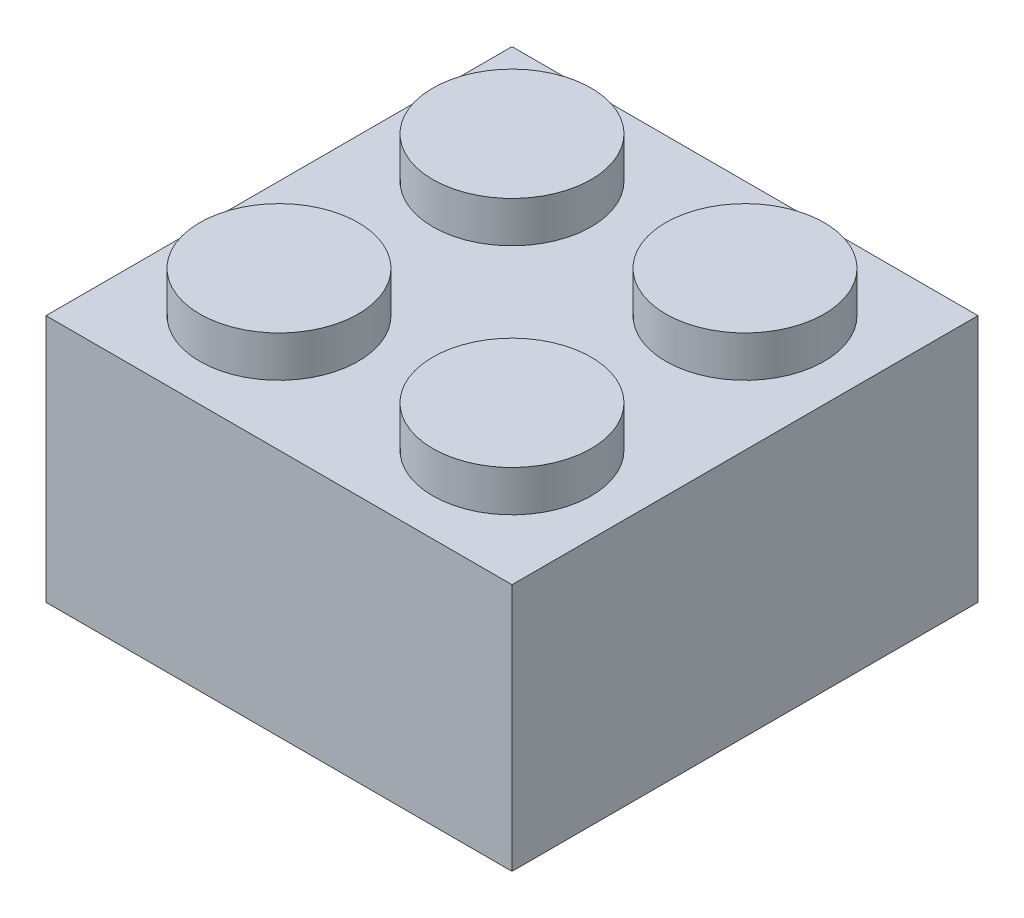
ISO-10303-21;
HEADER;
FILE_DESCRIPTION(('STEP AP214'),'2;1');
FILE_NAME('part.step','',(''),(''),'','','');
FILE_SCHEMA(('AUTOMOTIVE_DESIGN { 1 0 10303 214 1 1 1 1 }'));
ENDSEC;
DATA;
#1=APPLICATION_CONTEXT('core data for automotive mechanical design processes');
#2=APPLICATION_PROTOCOL_DEFINITION('international standard','automotive_design',2000,#1);
#3=PRODUCT_CONTEXT('',#1,'mechanical');
#4=PRODUCT('Part','Part','',(#3));
#5=PRODUCT_RELATED_PRODUCT_CATEGORY('part','',(#4));
#6=PRODUCT_DEFINITION_FORMATION('','',#4);
#7=PRODUCT_DEFINITION_CONTEXT('part definition',#1,'design');
#8=PRODUCT_DEFINITION('design','',#6,#7);
#9=PRODUCT_DEFINITION_SHAPE('','',#8);
#10=(LENGTH_UNIT() NAMED_UNIT(*) SI_UNIT(.MILLI.,.METRE.));
#11=(NAMED_UNIT(*) PLANE_ANGLE_UNIT() SI_UNIT($,.RADIAN.));
#12=(NAMED_UNIT(*) SI_UNIT($,.STERADIAN.) SOLID_ANGLE_UNIT());
#13=UNCERTAINTY_MEASURE_WITH_UNIT(LENGTH_MEASURE(1.E-05),#10,'distance_accuracy_value','');
#14=(GEOMETRIC_REPRESENTATION_CONTEXT(3) GLOBAL_UNCERTAINTY_ASSIGNED_CONTEXT((#13)) GLOBAL_UNIT_ASSIGNED_CONTEXT((#10,
#11,#12)) REPRESENTATION_CONTEXT('',''));
#15=CARTESIAN_POINT('',(0.,0.,0.));
#16=DIRECTION('',(0.,0.,1.));
#17=DIRECTION('',(1.,0.,0.));
#18=AXIS2_PLACEMENT_3D('',#15,#16,#17);
#19=CARTESIAN_POINT('',(7.93750000000001,4.2291,7.93749999999999));
#20=DIRECTION('',(0.,1.,0.));
#21=DIRECTION('',(0.,0.,1.));
#22=AXIS2_PLACEMENT_3D('',#19,#20,#21);
#23=PLANE('',#22);
#24=CARTESIAN_POINT('',(-3.96875,4.2291,3.96875));
#25=DIRECTION('',(0.,1.,0.));
#26=DIRECTION('',(0.,0.,1.));
#27=AXIS2_PLACEMENT_3D('',#24,#25,#26);
#28=CIRCLE('',#27,2.69875);
#29=CARTESIAN_POINT('',(-3.96875,4.2291,6.6675));
#30=VERTEX_POINT('',#29);
#31=EDGE_CURVE('E272',#30,#30,#28,.T.);
#32=ORIENTED_EDGE('',*,*,#31,.F.);
#33=EDGE_LOOP('',(#32));
#34=FACE_BOUND('',#33,.T.);
#35=CARTESIAN_POINT('',(3.96875,4.2291,3.96875));
#36=DIRECTION('',(0.,1.,0.));
#37=DIRECTION('',(0.,0.,1.));
#38=AXIS2_PLACEMENT_3D('',#35,#36,#37);
#39=CIRCLE('',#38,2.69875);
#40=CARTESIAN_POINT('',(3.96875,4.2291,6.6675));
#41=VERTEX_POINT('',#40);
#42=EDGE_CURVE('E287',#41,#41,#39,.T.);
#43=ORIENTED_EDGE('',*,*,#42,.F.);
#44=EDGE_LOOP('',(#43));
#45=FACE_BOUND('',#44,.T.);
#46=DIRECTION('',(0.,0.,-1.));
#47=VECTOR('',#46,1.);
#48=CARTESIAN_POINT('',(7.9375,4.2291,-7.9375));
#49=LINE('',#48,#47);
#50=CARTESIAN_POINT('',(7.93750000000001,4.2291,7.93749999999999));
#51=VERTEX_POINT('',#50);
#52=CARTESIAN_POINT('',(7.9375,4.2291,-7.9375));
#53=VERTEX_POINT('',#52);
#54=EDGE_CURVE('E161',#51,#53,#49,.T.);
#55=ORIENTED_EDGE('',*,*,#54,.T.);
#56=DIRECTION('',(-1.,0.,0.));
#57=VECTOR('',#56,1.);
#58=CARTESIAN_POINT('',(-7.9375,4.2291,-7.9375));
#59=LINE('',#58,#57);
#60=CARTESIAN_POINT('',(-7.9375,4.2291,-7.9375));
#61=VERTEX_POINT('',#60);
#62=EDGE_CURVE('E106',#53,#61,#59,.T.);
#63=ORIENTED_EDGE('',*,*,#62,.T.);
#64=DIRECTION('',(0.,0.,1.));
#65=VECTOR('',#64,1.);
#66=CARTESIAN_POINT('',(-7.9375,4.2291,-7.9375));
#67=LINE('',#66,#65);
#68=CARTESIAN_POINT('',(-7.93749999999999,4.2291,7.9375));
#69=VERTEX_POINT('',#68);
#70=EDGE_CURVE('E164',#61,#69,#67,.T.);
#71=ORIENTED_EDGE('',*,*,#70,.T.);
#72=DIRECTION('',(1.,0.,0.));
#73=VECTOR('',#72,1.);
#74=CARTESIAN_POINT('',(-7.93749999999999,4.2291,7.9375));
#75=LINE('',#74,#73);
#76=EDGE_CURVE('E78',#69,#51,#75,.T.);
#77=ORIENTED_EDGE('',*,*,#76,.T.);
#78=EDGE_LOOP('',(#55,#63,#71,#77));
#79=FACE_BOUND('',#78,.T.);
#80=CARTESIAN_POINT('',(3.96875,4.2291,-3.96875));
#81=DIRECTION('',(0.,1.,0.));
#82=DIRECTION('',(0.,0.,1.));
#83=AXIS2_PLACEMENT_3D('',#80,#81,#82);
#84=CIRCLE('',#83,2.69875);
#85=CARTESIAN_POINT('',(3.96875,4.2291,-1.27000000000001));
#86=VERTEX_POINT('',#85);
#87=EDGE_CURVE('E282',#86,#86,#84,.T.);
#88=ORIENTED_EDGE('',*,*,#87,.F.);
#89=EDGE_LOOP('',(#88));
#90=FACE_BOUND('',#89,.T.);
#91=CARTESIAN_POINT('',(-3.96875,4.2291,-3.96875));
#92=DIRECTION('',(0.,1.,0.));
#93=DIRECTION('',(0.,0.,1.));
#94=AXIS2_PLACEMENT_3D('',#91,#92,#93);
#95=CIRCLE('',#94,2.69875);
#96=CARTESIAN_POINT('',(-3.96875,4.2291,-1.27000000000001));
#97=VERTEX_POINT('',#96);
#98=EDGE_CURVE('E273',#97,#97,#95,.T.);
#99=ORIENTED_EDGE('',*,*,#98,.F.);
#100=EDGE_LOOP('',(#99));
#101=FACE_BOUND('',#100,.T.);
#102=ADVANCED_FACE('F54',(#34,#45,#79,#90,#101),#23,.T.);
#103=CARTESIAN_POINT('',(7.9375,4.2291,-7.9375));
#104=DIRECTION('',(-1.,0.,0.));
#105=DIRECTION('',(0.,0.,1.));
#106=AXIS2_PLACEMENT_3D('',#103,#104,#105);
#107=PLANE('',#106);
#108=DIRECTION('',(0.,0.,-1.));
#109=VECTOR('',#108,1.);
#110=CARTESIAN_POINT('',(7.9375,-4.2291,-7.9375));
#111=LINE('',#110,#109);
#112=CARTESIAN_POINT('',(7.93750000000001,-4.2291,7.93749999999999));
#113=VERTEX_POINT('',#112);
#114=CARTESIAN_POINT('',(7.9375,-4.2291,-7.9375));
#115=VERTEX_POINT('',#114);
#116=EDGE_CURVE('E168',#113,#115,#111,.T.);
#117=ORIENTED_EDGE('',*,*,#116,.T.);
#118=DIRECTION('',(0.,-1.,0.));
#119=VECTOR('',#118,1.);
#120=CARTESIAN_POINT('',(7.9375,4.2291,-7.9375));
#121=LINE('',#120,#119);
#122=EDGE_CURVE('E13',#53,#115,#121,.T.);
#123=ORIENTED_EDGE('',*,*,#122,.F.);
#124=ORIENTED_EDGE('',*,*,#54,.F.);
#125=DIRECTION('',(0.,-1.,0.));
#126=VECTOR('',#125,1.);
#127=CARTESIAN_POINT('',(7.93750000000001,4.2291,7.93749999999999));
#128=LINE('',#127,#126);
#129=EDGE_CURVE('E167',#51,#113,#128,.T.);
#130=ORIENTED_EDGE('',*,*,#129,.T.);
#131=EDGE_LOOP('',(#117,#123,#124,#130));
#132=FACE_BOUND('',#131,.T.);
#133=ADVANCED_FACE('F56',(#132),#107,.F.);
#134=CARTESIAN_POINT('',(-7.9375,4.2291,-7.9375));
#135=DIRECTION('',(0.,0.,1.));
#136=DIRECTION('',(1.,0.,0.));
#137=AXIS2_PLACEMENT_3D('',#134,#135,#136);
#138=PLANE('',#137);
#139=DIRECTION('',(-1.,0.,0.));
#140=VECTOR('',#139,1.);
#141=CARTESIAN_POINT('',(-7.9375,-4.2291,-7.9375));
#142=LINE('',#141,#140);
#143=CARTESIAN_POINT('',(-7.9375,-4.2291,-7.9375));
#144=VERTEX_POINT('',#143);
#145=EDGE_CURVE('E171',#115,#144,#142,.T.);
#146=ORIENTED_EDGE('',*,*,#145,.T.);
#147=DIRECTION('',(0.,-1.,0.));
#148=VECTOR('',#147,1.);
#149=CARTESIAN_POINT('',(-7.9375,4.2291,-7.9375));
#150=LINE('',#149,#148);
#151=EDGE_CURVE('E62',#61,#144,#150,.T.);
#152=ORIENTED_EDGE('',*,*,#151,.F.);
#153=ORIENTED_EDGE('',*,*,#62,.F.);
#154=ORIENTED_EDGE('',*,*,#122,.T.);
#155=EDGE_LOOP('',(#146,#152,#153,#154));
#156=FACE_BOUND('',#155,.T.);
#157=ADVANCED_FACE('F201',(#156),#138,.F.);
#158=CARTESIAN_POINT('',(-7.9375,4.2291,-7.9375));
#159=DIRECTION('',(1.,0.,0.));
#160=DIRECTION('',(0.,0.,-1.));
#161=AXIS2_PLACEMENT_3D('',#158,#159,#160);
#162=PLANE('',#161);
#163=DIRECTION('',(0.,0.,1.));
#164=VECTOR('',#163,1.);
#165=CARTESIAN_POINT('',(-7.9375,-4.2291,-7.9375));
#166=LINE('',#165,#164);
#167=CARTESIAN_POINT('',(-7.93749999999999,-4.2291,7.9375));
#168=VERTEX_POINT('',#167);
#169=EDGE_CURVE('E173',#144,#168,#166,.T.);
#170=ORIENTED_EDGE('',*,*,#169,.T.);
#171=DIRECTION('',(0.,-1.,0.));
#172=VECTOR('',#171,1.);
#173=CARTESIAN_POINT('',(-7.93749999999999,4.2291,7.9375));
#174=LINE('',#173,#172);
#175=EDGE_CURVE('E177',#69,#168,#174,.T.);
#176=ORIENTED_EDGE('',*,*,#175,.F.);
#177=ORIENTED_EDGE('',*,*,#70,.F.);
#178=ORIENTED_EDGE('',*,*,#151,.T.);
#179=EDGE_LOOP('',(#170,#176,#177,#178));
#180=FACE_BOUND('',#179,.T.);
#181=ADVANCED_FACE('F182',(#180),#162,.F.);
#182=CARTESIAN_POINT('',(-7.93749999999999,4.2291,7.9375));
#183=DIRECTION('',(0.,0.,-1.));
#184=DIRECTION('',(-1.,0.,0.));
#185=AXIS2_PLACEMENT_3D('',#182,#183,#184);
#186=PLANE('',#185);
#187=DIRECTION('',(1.,0.,0.));
#188=VECTOR('',#187,1.);
#189=CARTESIAN_POINT('',(-7.93749999999999,-4.2291,7.9375));
#190=LINE('',#189,#188);
#191=EDGE_CURVE('E99',#168,#113,#190,.T.);
#192=ORIENTED_EDGE('',*,*,#191,.T.);
#193=ORIENTED_EDGE('',*,*,#129,.F.);
#194=ORIENTED_EDGE('',*,*,#76,.F.);
#195=ORIENTED_EDGE('',*,*,#175,.T.);
#196=EDGE_LOOP('',(#192,#193,#194,#195));
#197=FACE_BOUND('',#196,.T.);
#198=ADVANCED_FACE('F190',(#197),#186,.F.);
#199=CARTESIAN_POINT('',(7.93750000000001,-4.2291,7.93749999999999));
#200=DIRECTION('',(0.,1.,0.));
#201=DIRECTION('',(0.,0.,1.));
#202=AXIS2_PLACEMENT_3D('',#199,#200,#201);
#203=PLANE('',#202);
#204=DIRECTION('',(0.,0.,1.));
#205=VECTOR('',#204,1.);
#206=CARTESIAN_POINT('',(6.6675,-4.2291,-17.6039213562373));
#207=LINE('',#206,#205);
#208=CARTESIAN_POINT('',(6.6675,-4.2291,-6.6675));
#209=VERTEX_POINT('',#208);
#210=CARTESIAN_POINT('',(6.66750000000001,-4.2291,6.66749999999999));
#211=VERTEX_POINT('',#210);
#212=EDGE_CURVE('E157',#209,#211,#207,.T.);
#213=ORIENTED_EDGE('',*,*,#212,.F.);
#214=DIRECTION('',(1.,0.,0.));
#215=VECTOR('',#214,1.);
#216=CARTESIAN_POINT('',(0.,-4.2291,-6.6675));
#217=LINE('',#216,#215);
#218=CARTESIAN_POINT('',(-6.6675,-4.2291,-6.6675));
#219=VERTEX_POINT('',#218);
#220=EDGE_CURVE('E312',#219,#209,#217,.T.);
#221=ORIENTED_EDGE('',*,*,#220,.F.);
#222=DIRECTION('',(0.,0.,-1.));
#223=VECTOR('',#222,1.);
#224=CARTESIAN_POINT('',(-6.6675,-4.2291,-17.6039213562373));
#225=LINE('',#224,#223);
#226=CARTESIAN_POINT('',(-6.66749999999999,-4.2291,6.6675));
#227=VERTEX_POINT('',#226);
#228=EDGE_CURVE('E152',#227,#219,#225,.T.);
#229=ORIENTED_EDGE('',*,*,#228,.F.);
#230=DIRECTION('',(-1.,0.,0.));
#231=VECTOR('',#230,1.);
#232=CARTESIAN_POINT('',(0.,-4.2291,6.6675));
#233=LINE('',#232,#231);
#234=EDGE_CURVE('E69',#211,#227,#233,.T.);
#235=ORIENTED_EDGE('',*,*,#234,.F.);
#236=EDGE_LOOP('',(#213,#221,#229,#235));
#237=FACE_BOUND('',#236,.T.);
#238=ORIENTED_EDGE('',*,*,#116,.F.);
#239=ORIENTED_EDGE('',*,*,#191,.F.);
#240=ORIENTED_EDGE('',*,*,#169,.F.);
#241=ORIENTED_EDGE('',*,*,#145,.F.);
#242=EDGE_LOOP('',(#238,#239,#240,#241));
#243=FACE_BOUND('',#242,.T.);
#244=ADVANCED_FACE('F186',(#237,#243),#203,.F.);
#245=CARTESIAN_POINT('',(0.,23.0876378542452,0.));
#246=DIRECTION('',(0.,-1.,0.));
#247=DIRECTION('',(0.,0.,-1.));
#248=AXIS2_PLACEMENT_3D('',#245,#246,#247);
#249=CYLINDRICAL_SURFACE('',#248,3.175);
#250=CARTESIAN_POINT('',(0.,-4.2291,0.));
#251=DIRECTION('',(0.,-1.,0.));
#252=DIRECTION('',(0.,0.,-1.));
#253=AXIS2_PLACEMENT_3D('',#250,#251,#252);
#254=CIRCLE('',#253,3.175);
#255=CARTESIAN_POINT('',(0.,-4.2291,-3.175));
#256=VERTEX_POINT('',#255);
#257=EDGE_CURVE('E148',#256,#256,#254,.T.);
#258=ORIENTED_EDGE('',*,*,#257,.F.);
#259=EDGE_LOOP('',(#258));
#260=FACE_BOUND('',#259,.T.);
#261=CARTESIAN_POINT('',(0.,2.9591,0.));
#262=DIRECTION('',(0.,1.,0.));
#263=DIRECTION('',(0.,0.,1.));
#264=AXIS2_PLACEMENT_3D('',#261,#262,#263);
#265=CIRCLE('',#264,3.175);
#266=CARTESIAN_POINT('',(0.,2.9591,3.175));
#267=VERTEX_POINT('',#266);
#268=EDGE_CURVE('E139',#267,#267,#265,.F.);
#269=ORIENTED_EDGE('',*,*,#268,.T.);
#270=EDGE_LOOP('',(#269));
#271=FACE_BOUND('',#270,.T.);
#272=ADVANCED_FACE('F197',(#260,#271),#249,.T.);
#273=CARTESIAN_POINT('',(0.,23.0876378542452,-6.6675));
#274=DIRECTION('',(0.,0.,-1.));
#275=DIRECTION('',(-1.,0.,0.));
#276=AXIS2_PLACEMENT_3D('',#273,#274,#275);
#277=PLANE('',#276);
#278=DIRECTION('',(0.,-1.,0.));
#279=VECTOR('',#278,1.);
#280=CARTESIAN_POINT('',(-6.6675,23.0876378542452,-6.6675));
#281=LINE('',#280,#279);
#282=CARTESIAN_POINT('',(-6.6675,2.9591,-6.6675));
#283=VERTEX_POINT('',#282);
#284=EDGE_CURVE('E134',#283,#219,#281,.T.);
#285=ORIENTED_EDGE('',*,*,#284,.T.);
#286=ORIENTED_EDGE('',*,*,#220,.T.);
#287=DIRECTION('',(0.,-1.,0.));
#288=VECTOR('',#287,1.);
#289=CARTESIAN_POINT('',(6.6675,23.0876378542452,-6.6675));
#290=LINE('',#289,#288);
#291=CARTESIAN_POINT('',(6.6675,2.9591,-6.6675));
#292=VERTEX_POINT('',#291);
#293=EDGE_CURVE('E136',#292,#209,#290,.T.);
#294=ORIENTED_EDGE('',*,*,#293,.F.);
#295=DIRECTION('',(1.,0.,0.));
#296=VECTOR('',#295,1.);
#297=CARTESIAN_POINT('',(0.,2.9591,-6.6675));
#298=LINE('',#297,#296);
#299=EDGE_CURVE('E129',#283,#292,#298,.T.);
#300=ORIENTED_EDGE('',*,*,#299,.F.);
#301=EDGE_LOOP('',(#285,#286,#294,#300));
#302=FACE_BOUND('',#301,.T.);
#303=ADVANCED_FACE('F131',(#302),#277,.F.);
#304=CARTESIAN_POINT('',(6.6675,23.0876378542452,-17.6039213562373));
#305=DIRECTION('',(1.,0.,0.));
#306=DIRECTION('',(0.,0.,-1.));
#307=AXIS2_PLACEMENT_3D('',#304,#305,#306);
#308=PLANE('',#307);
#309=ORIENTED_EDGE('',*,*,#293,.T.);
#310=ORIENTED_EDGE('',*,*,#212,.T.);
#311=DIRECTION('',(0.,-1.,0.));
#312=VECTOR('',#311,1.);
#313=CARTESIAN_POINT('',(6.66750000000001,23.0876378542452,6.66749999999999));
#314=LINE('',#313,#312);
#315=CARTESIAN_POINT('',(6.66750000000001,2.9591,6.66749999999999));
#316=VERTEX_POINT('',#315);
#317=EDGE_CURVE('E155',#316,#211,#314,.T.);
#318=ORIENTED_EDGE('',*,*,#317,.F.);
#319=DIRECTION('',(0.,0.,1.));
#320=VECTOR('',#319,1.);
#321=CARTESIAN_POINT('',(6.6675,2.9591,-17.6039213562373));
#322=LINE('',#321,#320);
#323=EDGE_CURVE('E304',#292,#316,#322,.T.);
#324=ORIENTED_EDGE('',*,*,#323,.F.);
#325=EDGE_LOOP('',(#309,#310,#318,#324));
#326=FACE_BOUND('',#325,.T.);
#327=ADVANCED_FACE('F220',(#326),#308,.F.);
#328=CARTESIAN_POINT('',(0.,23.0876378542452,6.6675));
#329=DIRECTION('',(0.,0.,1.));
#330=DIRECTION('',(1.,0.,0.));
#331=AXIS2_PLACEMENT_3D('',#328,#329,#330);
#332=PLANE('',#331);
#333=ORIENTED_EDGE('',*,*,#317,.T.);
#334=ORIENTED_EDGE('',*,*,#234,.T.);
#335=DIRECTION('',(0.,-1.,0.));
#336=VECTOR('',#335,1.);
#337=CARTESIAN_POINT('',(-6.66749999999999,23.0876378542452,6.6675));
#338=LINE('',#337,#336);
#339=CARTESIAN_POINT('',(-6.66749999999999,2.9591,6.6675));
#340=VERTEX_POINT('',#339);
#341=EDGE_CURVE('E140',#340,#227,#338,.T.);
#342=ORIENTED_EDGE('',*,*,#341,.F.);
#343=DIRECTION('',(-1.,0.,0.));
#344=VECTOR('',#343,1.);
#345=CARTESIAN_POINT('',(0.,2.9591,6.6675));
#346=LINE('',#345,#344);
#347=EDGE_CURVE('E146',#316,#340,#346,.T.);
#348=ORIENTED_EDGE('',*,*,#347,.F.);
#349=EDGE_LOOP('',(#333,#334,#342,#348));
#350=FACE_BOUND('',#349,.T.);
#351=ADVANCED_FACE('F217',(#350),#332,.F.);
#352=CARTESIAN_POINT('',(-6.6675,23.0876378542452,-17.6039213562373));
#353=DIRECTION('',(-1.,0.,0.));
#354=DIRECTION('',(0.,0.,1.));
#355=AXIS2_PLACEMENT_3D('',#352,#353,#354);
#356=PLANE('',#355);
#357=ORIENTED_EDGE('',*,*,#341,.T.);
#358=ORIENTED_EDGE('',*,*,#228,.T.);
#359=ORIENTED_EDGE('',*,*,#284,.F.);
#360=DIRECTION('',(0.,0.,-1.));
#361=VECTOR('',#360,1.);
#362=CARTESIAN_POINT('',(-6.6675,2.9591,-17.6039213562373));
#363=LINE('',#362,#361);
#364=EDGE_CURVE('E143',#340,#283,#363,.T.);
#365=ORIENTED_EDGE('',*,*,#364,.F.);
#366=EDGE_LOOP('',(#357,#358,#359,#365));
#367=FACE_BOUND('',#366,.T.);
#368=ADVANCED_FACE('F150',(#367),#356,.F.);
#369=CARTESIAN_POINT('',(7.93750000000001,2.9591,7.93749999999999));
#370=DIRECTION('',(0.,1.,0.));
#371=DIRECTION('',(0.,0.,1.));
#372=AXIS2_PLACEMENT_3D('',#369,#370,#371);
#373=PLANE('',#372);
#374=ORIENTED_EDGE('',*,*,#364,.T.);
#375=ORIENTED_EDGE('',*,*,#299,.T.);
#376=ORIENTED_EDGE('',*,*,#323,.T.);
#377=ORIENTED_EDGE('',*,*,#347,.T.);
#378=EDGE_LOOP('',(#374,#375,#376,#377));
#379=FACE_BOUND('',#378,.T.);
#380=ORIENTED_EDGE('',*,*,#268,.F.);
#381=EDGE_LOOP('',(#380));
#382=FACE_BOUND('',#381,.T.);
#383=ADVANCED_FACE('F144',(#379,#382),#373,.F.);
#384=CARTESIAN_POINT('',(0.,-4.2291,0.));
#385=DIRECTION('',(0.,-1.,0.));
#386=DIRECTION('',(0.,0.,-1.));
#387=AXIS2_PLACEMENT_3D('',#384,#385,#386);
#388=CIRCLE('',#387,2.413);
#389=CARTESIAN_POINT('',(0.,-4.2291,-2.413));
#390=VERTEX_POINT('',#389);
#391=EDGE_CURVE('E294',#390,#390,#388,.T.);
#392=ORIENTED_EDGE('',*,*,#391,.F.);
#393=EDGE_LOOP('',(#392));
#394=FACE_BOUND('',#393,.T.);
#395=ORIENTED_EDGE('',*,*,#257,.T.);
#396=EDGE_LOOP('',(#395));
#397=FACE_BOUND('',#396,.T.);
#398=ADVANCED_FACE('F200',(#394,#397),#203,.F.);
#399=CARTESIAN_POINT('',(7.93750000000001,2.9591,7.93749999999999));
#400=DIRECTION('',(0.,1.,0.));
#401=DIRECTION('',(0.,0.,1.));
#402=AXIS2_PLACEMENT_3D('',#399,#400,#401);
#403=PLANE('',#402);
#404=CARTESIAN_POINT('',(0.,2.9591,0.));
#405=DIRECTION('',(0.,1.,0.));
#406=DIRECTION('',(0.,0.,1.));
#407=AXIS2_PLACEMENT_3D('',#404,#405,#406);
#408=CIRCLE('',#407,2.413);
#409=CARTESIAN_POINT('',(0.,2.9591,2.413));
#410=VERTEX_POINT('',#409);
#411=EDGE_CURVE('E300',#410,#410,#408,.F.);
#412=ORIENTED_EDGE('',*,*,#411,.T.);
#413=EDGE_LOOP('',(#412));
#414=FACE_BOUND('',#413,.T.);
#415=ADVANCED_FACE('F228',(#414),#403,.F.);
#416=CARTESIAN_POINT('',(0.,23.0876378542452,0.));
#417=DIRECTION('',(0.,-1.,0.));
#418=DIRECTION('',(0.,0.,-1.));
#419=AXIS2_PLACEMENT_3D('',#416,#417,#418);
#420=CYLINDRICAL_SURFACE('',#419,2.413);
#421=ORIENTED_EDGE('',*,*,#391,.T.);
#422=EDGE_LOOP('',(#421));
#423=FACE_BOUND('',#422,.T.);
#424=ORIENTED_EDGE('',*,*,#411,.F.);
#425=EDGE_LOOP('',(#424));
#426=FACE_BOUND('',#425,.T.);
#427=ADVANCED_FACE('F231',(#423,#426),#420,.F.);
#428=CARTESIAN_POINT('',(3.96875,5.6261,3.96875));
#429=DIRECTION('',(0.,-1.,0.));
#430=DIRECTION('',(0.,0.,-1.));
#431=AXIS2_PLACEMENT_3D('',#428,#429,#430);
#432=CYLINDRICAL_SURFACE('',#431,2.69875);
#433=CARTESIAN_POINT('',(3.96875,5.6261,3.96875));
#434=DIRECTION('',(0.,1.,0.));
#435=DIRECTION('',(0.,0.,1.));
#436=AXIS2_PLACEMENT_3D('',#433,#434,#435);
#437=CIRCLE('',#436,2.69875);
#438=CARTESIAN_POINT('',(3.96875,5.6261,6.6675));
#439=VERTEX_POINT('',#438);
#440=EDGE_CURVE('E290',#439,#439,#437,.T.);
#441=ORIENTED_EDGE('',*,*,#440,.F.);
#442=EDGE_LOOP('',(#441));
#443=FACE_BOUND('',#442,.T.);
#444=ORIENTED_EDGE('',*,*,#42,.T.);
#445=EDGE_LOOP('',(#444));
#446=FACE_BOUND('',#445,.T.);
#447=ADVANCED_FACE('F235',(#443,#446),#432,.T.);
#448=CARTESIAN_POINT('',(3.96875,5.6261,3.96875));
#449=DIRECTION('',(0.,1.,0.));
#450=DIRECTION('',(0.,0.,1.));
#451=AXIS2_PLACEMENT_3D('',#448,#449,#450);
#452=PLANE('',#451);
#453=ORIENTED_EDGE('',*,*,#440,.T.);
#454=EDGE_LOOP('',(#453));
#455=FACE_BOUND('',#454,.T.);
#456=ADVANCED_FACE('F239',(#455),#452,.T.);
#457=CARTESIAN_POINT('',(3.96875,5.6261,-3.96875));
#458=DIRECTION('',(0.,-1.,0.));
#459=DIRECTION('',(0.,0.,-1.));
#460=AXIS2_PLACEMENT_3D('',#457,#458,#459);
#461=CYLINDRICAL_SURFACE('',#460,2.69875);
#462=CARTESIAN_POINT('',(3.96875,5.6261,-3.96875));
#463=DIRECTION('',(0.,1.,0.));
#464=DIRECTION('',(0.,0.,1.));
#465=AXIS2_PLACEMENT_3D('',#462,#463,#464);
#466=CIRCLE('',#465,2.69875);
#467=CARTESIAN_POINT('',(3.96875,5.6261,-1.27000000000001));
#468=VERTEX_POINT('',#467);
#469=EDGE_CURVE('E284',#468,#468,#466,.T.);
#470=ORIENTED_EDGE('',*,*,#469,.F.);
#471=EDGE_LOOP('',(#470));
#472=FACE_BOUND('',#471,.T.);
#473=ORIENTED_EDGE('',*,*,#87,.T.);
#474=EDGE_LOOP('',(#473));
#475=FACE_BOUND('',#474,.T.);
#476=ADVANCED_FACE('F243',(#472,#475),#461,.T.);
#477=CARTESIAN_POINT('',(3.96875,5.6261,-3.96875));
#478=DIRECTION('',(0.,1.,0.));
#479=DIRECTION('',(0.,0.,1.));
#480=AXIS2_PLACEMENT_3D('',#477,#478,#479);
#481=PLANE('',#480);
#482=ORIENTED_EDGE('',*,*,#469,.T.);
#483=EDGE_LOOP('',(#482));
#484=FACE_BOUND('',#483,.T.);
#485=ADVANCED_FACE('F247',(#484),#481,.T.);
#486=CARTESIAN_POINT('',(-3.96875,5.6261,3.96875));
#487=DIRECTION('',(0.,-1.,0.));
#488=DIRECTION('',(0.,0.,-1.));
#489=AXIS2_PLACEMENT_3D('',#486,#487,#488);
#490=CYLINDRICAL_SURFACE('',#489,2.69875);
#491=CARTESIAN_POINT('',(-3.96875,5.6261,3.96875));
#492=DIRECTION('',(0.,1.,0.));
#493=DIRECTION('',(0.,0.,1.));
#494=AXIS2_PLACEMENT_3D('',#491,#492,#493);
#495=CIRCLE('',#494,2.69875);
#496=CARTESIAN_POINT('',(-3.96875,5.6261,6.6675));
#497=VERTEX_POINT('',#496);
#498=EDGE_CURVE('E276',#497,#497,#495,.T.);
#499=ORIENTED_EDGE('',*,*,#498,.F.);
#500=EDGE_LOOP('',(#499));
#501=FACE_BOUND('',#500,.T.);
#502=ORIENTED_EDGE('',*,*,#31,.T.);
#503=EDGE_LOOP('',(#502));
#504=FACE_BOUND('',#503,.T.);
#505=ADVANCED_FACE('F251',(#501,#504),#490,.T.);
#506=CARTESIAN_POINT('',(-3.96875,5.6261,3.96875));
#507=DIRECTION('',(0.,1.,0.));
#508=DIRECTION('',(0.,0.,1.));
#509=AXIS2_PLACEMENT_3D('',#506,#507,#508);
#510=PLANE('',#509);
#511=ORIENTED_EDGE('',*,*,#498,.T.);
#512=EDGE_LOOP('',(#511));
#513=FACE_BOUND('',#512,.T.);
#514=ADVANCED_FACE('F255',(#513),#510,.T.);
#515=CARTESIAN_POINT('',(-3.96875,5.6261,-3.96875));
#516=DIRECTION('',(0.,-1.,0.));
#517=DIRECTION('',(0.,0.,-1.));
#518=AXIS2_PLACEMENT_3D('',#515,#516,#517);
#519=CYLINDRICAL_SURFACE('',#518,2.69875);
#520=CARTESIAN_POINT('',(-3.96875,5.6261,-3.96875));
#521=DIRECTION('',(0.,1.,0.));
#522=DIRECTION('',(0.,0.,1.));
#523=AXIS2_PLACEMENT_3D('',#520,#521,#522);
#524=CIRCLE('',#523,2.69875);
#525=CARTESIAN_POINT('',(-3.96875,5.6261,-1.27000000000001));
#526=VERTEX_POINT('',#525);
#527=EDGE_CURVE('E271',#526,#526,#524,.T.);
#528=ORIENTED_EDGE('',*,*,#527,.F.);
#529=EDGE_LOOP('',(#528));
#530=FACE_BOUND('',#529,.T.);
#531=ORIENTED_EDGE('',*,*,#98,.T.);
#532=EDGE_LOOP('',(#531));
#533=FACE_BOUND('',#532,.T.);
#534=ADVANCED_FACE('F259',(#530,#533),#519,.T.);
#535=CARTESIAN_POINT('',(-3.96875,5.6261,-3.96875));
#536=DIRECTION('',(0.,1.,0.));
#537=DIRECTION('',(0.,0.,1.));
#538=AXIS2_PLACEMENT_3D('',#535,#536,#537);
#539=PLANE('',#538);
#540=ORIENTED_EDGE('',*,*,#527,.T.);
#541=EDGE_LOOP('',(#540));
#542=FACE_BOUND('',#541,.T.);
#543=ADVANCED_FACE('F263',(#542),#539,.T.);
#544=CLOSED_SHELL('',(#102,#133,#157,#181,#198,#244,#272,#303,#327,#351,#368,#383,#398,#415,
#427,#447,#456,#476,#485,#505,#514,#534,#543));
#545=MANIFOLD_SOLID_BREP('B2',#544);
#546=ADVANCED_BREP_SHAPE_REPRESENTATION('',(#18,#545),#14);
#547=SHAPE_DEFINITION_REPRESENTATION(#9,#546);
ENDSEC;
END-ISO-10303-21;
